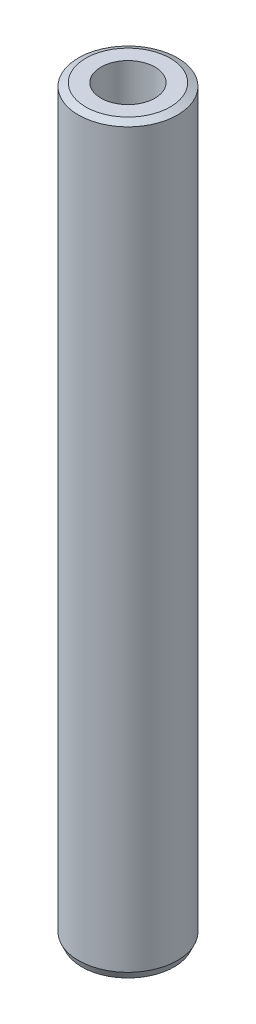
ISO-10303-21;
HEADER;
FILE_DESCRIPTION(('STEP AP214'),'2;1');
FILE_NAME('part.step','',(''),(''),'','','');
FILE_SCHEMA(('AUTOMOTIVE_DESIGN { 1 0 10303 214 1 1 1 1 }'));
ENDSEC;
DATA;
#1=APPLICATION_CONTEXT('core data for automotive mechanical design processes');
#2=APPLICATION_PROTOCOL_DEFINITION('international standard','automotive_design',2000,#1);
#3=PRODUCT_CONTEXT('',#1,'mechanical');
#4=PRODUCT('Part','Part','',(#3));
#5=PRODUCT_RELATED_PRODUCT_CATEGORY('part','',(#4));
#6=PRODUCT_DEFINITION_FORMATION('','',#4);
#7=PRODUCT_DEFINITION_CONTEXT('part definition',#1,'design');
#8=PRODUCT_DEFINITION('design','',#6,#7);
#9=PRODUCT_DEFINITION_SHAPE('','',#8);
#10=(LENGTH_UNIT() NAMED_UNIT(*) SI_UNIT(.MILLI.,.METRE.));
#11=(NAMED_UNIT(*) PLANE_ANGLE_UNIT() SI_UNIT($,.RADIAN.));
#12=(NAMED_UNIT(*) SI_UNIT($,.STERADIAN.) SOLID_ANGLE_UNIT());
#13=UNCERTAINTY_MEASURE_WITH_UNIT(LENGTH_MEASURE(1.E-05),#10,'distance_accuracy_value','');
#14=(GEOMETRIC_REPRESENTATION_CONTEXT(3) GLOBAL_UNCERTAINTY_ASSIGNED_CONTEXT((#13)) GLOBAL_UNIT_ASSIGNED_CONTEXT((#10,
#11,#12)) REPRESENTATION_CONTEXT('',''));
#15=CARTESIAN_POINT('',(0.,0.,0.));
#16=DIRECTION('',(0.,0.,1.));
#17=DIRECTION('',(1.,0.,0.));
#18=AXIS2_PLACEMENT_3D('',#15,#16,#17);
#19=CARTESIAN_POINT('',(0.,600.,0.));
#20=DIRECTION('',(0.,-1.,0.));
#21=DIRECTION('',(0.,0.,-1.));
#22=AXIS2_PLACEMENT_3D('',#19,#20,#21);
#23=CYLINDRICAL_SURFACE('',#22,40.);
#24=CARTESIAN_POINT('',(0.,597.318764054973,0.));
#25=DIRECTION('',(0.,1.,0.));
#26=DIRECTION('',(0.,0.,1.));
#27=AXIS2_PLACEMENT_3D('',#24,#25,#26);
#28=CIRCLE('',#27,40.);
#29=CARTESIAN_POINT('',(0.,597.318764054973,40.));
#30=VERTEX_POINT('',#29);
#31=EDGE_CURVE('E50',#30,#30,#28,.F.);
#32=ORIENTED_EDGE('',*,*,#31,.T.);
#33=EDGE_LOOP('',(#32));
#34=FACE_BOUND('',#33,.T.);
#35=CARTESIAN_POINT('',(0.,5.87537905214919,0.));
#36=DIRECTION('',(0.,1.,0.));
#37=DIRECTION('',(0.,0.,1.));
#38=AXIS2_PLACEMENT_3D('',#35,#36,#37);
#39=CIRCLE('',#38,40.);
#40=CARTESIAN_POINT('',(0.,5.87537905214919,40.));
#41=VERTEX_POINT('',#40);
#42=EDGE_CURVE('E51',#41,#41,#39,.T.);
#43=ORIENTED_EDGE('',*,*,#42,.T.);
#44=EDGE_LOOP('',(#43));
#45=FACE_BOUND('',#44,.T.);
#46=ADVANCED_FACE('F39',(#34,#45),#23,.T.);
#47=CARTESIAN_POINT('',(0.,600.,0.));
#48=DIRECTION('',(0.,1.,0.));
#49=DIRECTION('',(0.,0.,1.));
#50=AXIS2_PLACEMENT_3D('',#47,#48,#49);
#51=PLANE('',#50);
#52=CARTESIAN_POINT('',(0.,600.,0.));
#53=DIRECTION('',(0.,1.,0.));
#54=DIRECTION('',(0.,0.,1.));
#55=AXIS2_PLACEMENT_3D('',#52,#53,#54);
#56=CIRCLE('',#55,34.1246209478505);
#57=CARTESIAN_POINT('',(0.,600.,34.1246209478505));
#58=VERTEX_POINT('',#57);
#59=EDGE_CURVE('E54',#58,#58,#56,.T.);
#60=ORIENTED_EDGE('',*,*,#59,.T.);
#61=EDGE_LOOP('',(#60));
#62=FACE_BOUND('',#61,.T.);
#63=CARTESIAN_POINT('',(0.,600.,0.));
#64=DIRECTION('',(0.,1.,0.));
#65=DIRECTION('',(0.,0.,1.));
#66=AXIS2_PLACEMENT_3D('',#63,#64,#65);
#67=CIRCLE('',#66,21.8086135001139);
#68=CARTESIAN_POINT('',(0.,600.,21.8086135001139));
#69=VERTEX_POINT('',#68);
#70=EDGE_CURVE('E58',#69,#69,#67,.T.);
#71=ORIENTED_EDGE('',*,*,#70,.F.);
#72=EDGE_LOOP('',(#71));
#73=FACE_BOUND('',#72,.T.);
#74=ADVANCED_FACE('F69',(#62,#73),#51,.T.);
#75=CARTESIAN_POINT('',(0.,0.,0.));
#76=DIRECTION('',(0.,1.,0.));
#77=DIRECTION('',(0.,0.,1.));
#78=AXIS2_PLACEMENT_3D('',#75,#76,#77);
#79=PLANE('',#78);
#80=CARTESIAN_POINT('',(0.,0.,0.));
#81=DIRECTION('',(0.,1.,0.));
#82=DIRECTION('',(0.,0.,1.));
#83=AXIS2_PLACEMENT_3D('',#80,#81,#82);
#84=CIRCLE('',#83,37.3187640549733);
#85=CARTESIAN_POINT('',(0.,0.,37.3187640549733));
#86=VERTEX_POINT('',#85);
#87=EDGE_CURVE('E10',#86,#86,#84,.F.);
#88=ORIENTED_EDGE('',*,*,#87,.T.);
#89=EDGE_LOOP('',(#88));
#90=FACE_BOUND('',#89,.T.);
#91=CARTESIAN_POINT('',(0.,0.,0.));
#92=DIRECTION('',(0.,1.,0.));
#93=DIRECTION('',(0.,0.,1.));
#94=AXIS2_PLACEMENT_3D('',#91,#92,#93);
#95=CIRCLE('',#94,21.8086135001139);
#96=CARTESIAN_POINT('',(0.,0.,21.8086135001139));
#97=VERTEX_POINT('',#96);
#98=EDGE_CURVE('E63',#97,#97,#95,.T.);
#99=ORIENTED_EDGE('',*,*,#98,.T.);
#100=EDGE_LOOP('',(#99));
#101=FACE_BOUND('',#100,.T.);
#102=ADVANCED_FACE('F75',(#90,#101),#79,.F.);
#103=CARTESIAN_POINT('',(0.,600.,0.));
#104=DIRECTION('',(0.,-1.,0.));
#105=DIRECTION('',(0.,0.,-1.));
#106=AXIS2_PLACEMENT_3D('',#103,#104,#105);
#107=CYLINDRICAL_SURFACE('',#106,21.8086135001139);
#108=ORIENTED_EDGE('',*,*,#70,.T.);
#109=EDGE_LOOP('',(#108));
#110=FACE_BOUND('',#109,.T.);
#111=ORIENTED_EDGE('',*,*,#98,.F.);
#112=EDGE_LOOP('',(#111));
#113=FACE_BOUND('',#112,.T.);
#114=ADVANCED_FACE('F70',(#110,#113),#107,.F.);
#115=CARTESIAN_POINT('',(0.,600.,0.));
#116=DIRECTION('',(0.,-1.,0.));
#117=DIRECTION('',(0.,0.,-1.));
#118=AXIS2_PLACEMENT_3D('',#115,#116,#117);
#119=CONICAL_SURFACE('',#118,34.1246209478505,1.14267335695653);
#120=ORIENTED_EDGE('',*,*,#31,.F.);
#121=EDGE_LOOP('',(#120));
#122=FACE_BOUND('',#121,.T.);
#123=ORIENTED_EDGE('',*,*,#59,.F.);
#124=EDGE_LOOP('',(#123));
#125=FACE_BOUND('',#124,.T.);
#126=ADVANCED_FACE('F81',(#122,#125),#119,.T.);
#127=CARTESIAN_POINT('',(0.,5.87537905214919,0.));
#128=DIRECTION('',(0.,1.,0.));
#129=DIRECTION('',(0.,0.,1.));
#130=AXIS2_PLACEMENT_3D('',#127,#128,#129);
#131=CONICAL_SURFACE('',#130,40.,0.428122969838374);
#132=ORIENTED_EDGE('',*,*,#87,.F.);
#133=EDGE_LOOP('',(#132));
#134=FACE_BOUND('',#133,.T.);
#135=ORIENTED_EDGE('',*,*,#42,.F.);
#136=EDGE_LOOP('',(#135));
#137=FACE_BOUND('',#136,.T.);
#138=ADVANCED_FACE('F45',(#134,#137),#131,.T.);
#139=CLOSED_SHELL('',(#46,#74,#102,#114,#126,#138));
#140=MANIFOLD_SOLID_BREP('B2',#139);
#141=ADVANCED_BREP_SHAPE_REPRESENTATION('',(#18,#140),#14);
#142=SHAPE_DEFINITION_REPRESENTATION(#9,#141);
ENDSEC;
END-ISO-10303-21;
